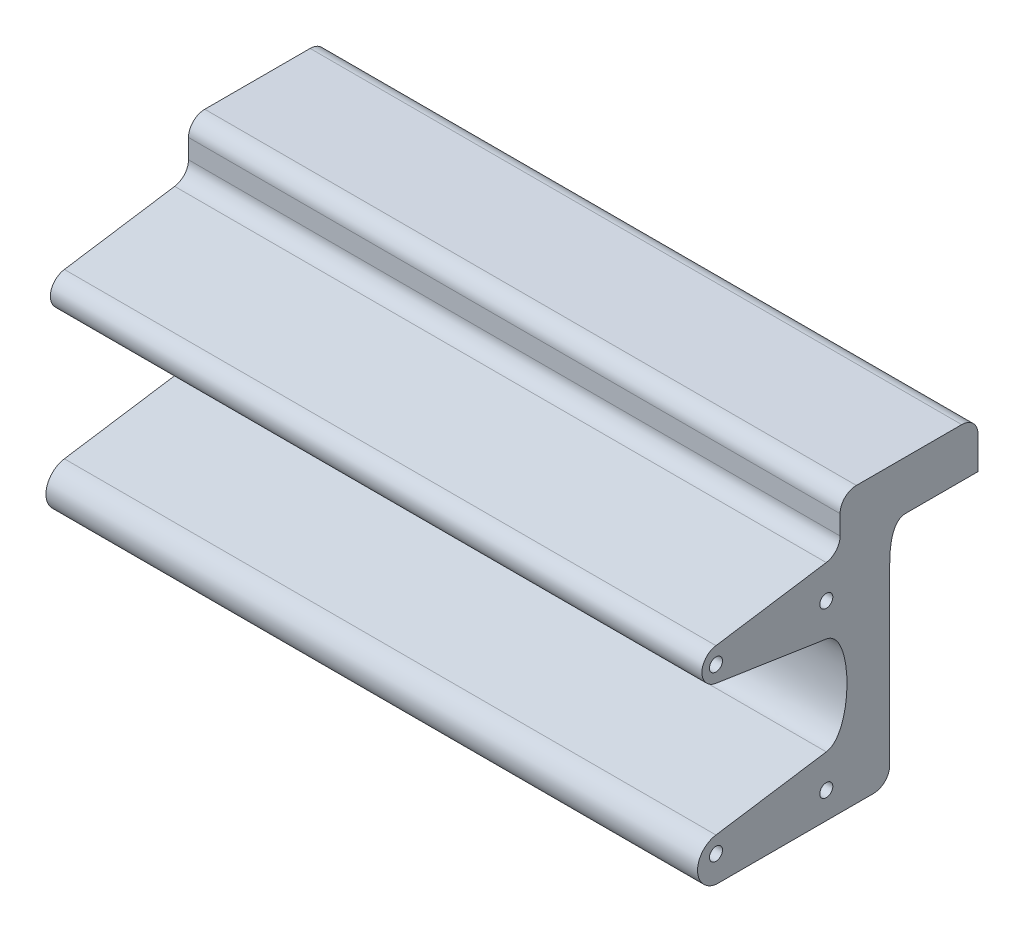
ISO-10303-21;
HEADER;
FILE_DESCRIPTION(('STEP AP214'),'2;1');
FILE_NAME('part.step','',(''),(''),'','','');
FILE_SCHEMA(('AUTOMOTIVE_DESIGN { 1 0 10303 214 1 1 1 1 }'));
ENDSEC;
DATA;
#1=APPLICATION_CONTEXT('core data for automotive mechanical design processes');
#2=APPLICATION_PROTOCOL_DEFINITION('international standard','automotive_design',2000,#1);
#3=PRODUCT_CONTEXT('',#1,'mechanical');
#4=PRODUCT('Part','Part','',(#3));
#5=PRODUCT_RELATED_PRODUCT_CATEGORY('part','',(#4));
#6=PRODUCT_DEFINITION_FORMATION('','',#4);
#7=PRODUCT_DEFINITION_CONTEXT('part definition',#1,'design');
#8=PRODUCT_DEFINITION('design','',#6,#7);
#9=PRODUCT_DEFINITION_SHAPE('','',#8);
#10=(LENGTH_UNIT() NAMED_UNIT(*) SI_UNIT(.MILLI.,.METRE.));
#11=(NAMED_UNIT(*) PLANE_ANGLE_UNIT() SI_UNIT($,.RADIAN.));
#12=(NAMED_UNIT(*) SI_UNIT($,.STERADIAN.) SOLID_ANGLE_UNIT());
#13=UNCERTAINTY_MEASURE_WITH_UNIT(LENGTH_MEASURE(1.E-05),#10,'distance_accuracy_value','');
#14=(GEOMETRIC_REPRESENTATION_CONTEXT(3) GLOBAL_UNCERTAINTY_ASSIGNED_CONTEXT((#13)) GLOBAL_UNIT_ASSIGNED_CONTEXT((#10,
#11,#12)) REPRESENTATION_CONTEXT('',''));
#15=CARTESIAN_POINT('',(0.,0.,0.));
#16=DIRECTION('',(0.,0.,1.));
#17=DIRECTION('',(1.,0.,0.));
#18=AXIS2_PLACEMENT_3D('',#15,#16,#17);
#19=CARTESIAN_POINT('',(100.,-5.51166666666667,14.8));
#20=DIRECTION('',(-1.,0.,0.));
#21=DIRECTION('',(0.,0.,1.));
#22=AXIS2_PLACEMENT_3D('',#19,#20,#21);
#23=PLANE('',#22);
#24=DIRECTION('',(0.,1.,0.));
#25=VECTOR('',#24,1.);
#26=CARTESIAN_POINT('',(100.,12.25,-11.05));
#27=LINE('',#26,#25);
#28=CARTESIAN_POINT('',(100.,-2.74999999999999,-11.05));
#29=VERTEX_POINT('',#28);
#30=CARTESIAN_POINT('',(100.,7.25,-11.05));
#31=VERTEX_POINT('',#30);
#32=EDGE_CURVE('E316',#29,#31,#27,.T.);
#33=ORIENTED_EDGE('',*,*,#32,.T.);
#34=CARTESIAN_POINT('',(100.,7.25,-6.05000000000001));
#35=DIRECTION('',(-1.,0.,0.));
#36=DIRECTION('',(0.,0.,1.));
#37=AXIS2_PLACEMENT_3D('',#34,#35,#36);
#38=CIRCLE('',#37,5.);
#39=CARTESIAN_POINT('',(100.,12.25,-6.05000000000001));
#40=VERTEX_POINT('',#39);
#41=EDGE_CURVE('E353',#31,#40,#38,.F.);
#42=ORIENTED_EDGE('',*,*,#41,.T.);
#43=DIRECTION('',(0.,0.,1.));
#44=VECTOR('',#43,1.);
#45=CARTESIAN_POINT('',(100.,12.25,-11.05));
#46=LINE('',#45,#44);
#47=CARTESIAN_POINT('',(100.,12.25,26.2833333333333));
#48=VERTEX_POINT('',#47);
#49=EDGE_CURVE('E376',#40,#48,#46,.T.);
#50=ORIENTED_EDGE('',*,*,#49,.T.);
#51=CARTESIAN_POINT('',(100.,7.25000000000001,26.2833333333333));
#52=DIRECTION('',(-1.,0.,0.));
#53=DIRECTION('',(0.,0.,1.));
#54=AXIS2_PLACEMENT_3D('',#51,#52,#53);
#55=CIRCLE('',#54,5.);
#56=CARTESIAN_POINT('',(100.,7.25000000000001,31.2833333333333));
#57=VERTEX_POINT('',#56);
#58=EDGE_CURVE('E351',#48,#57,#55,.F.);
#59=ORIENTED_EDGE('',*,*,#58,.T.);
#60=DIRECTION('',(0.,-1.,0.));
#61=VECTOR('',#60,1.);
#62=CARTESIAN_POINT('',(100.,12.25,31.2833333333333));
#63=LINE('',#62,#61);
#64=CARTESIAN_POINT('',(100.,1.31089229297101,31.2833333333333));
#65=VERTEX_POINT('',#64);
#66=EDGE_CURVE('E165',#57,#65,#63,.T.);
#67=ORIENTED_EDGE('',*,*,#66,.T.);
#68=CARTESIAN_POINT('',(100.,1.31089229297101,36.2833333333333));
#69=DIRECTION('',(-1.,0.,0.));
#70=DIRECTION('',(0.,0.,1.));
#71=AXIS2_PLACEMENT_3D('',#68,#69,#70);
#72=CIRCLE('',#71,5.);
#73=CARTESIAN_POINT('',(100.,-3.63209960127043,35.5304514478669));
#74=VERTEX_POINT('',#73);
#75=EDGE_CURVE('E11',#65,#74,#72,.T.);
#76=ORIENTED_EDGE('',*,*,#75,.T.);
#77=DIRECTION('',(0.,-0.15057637709328,0.988598378848288));
#78=VECTOR('',#77,1.);
#79=CARTESIAN_POINT('',(100.,-2.98520833333334,31.2833333333333));
#80=LINE('',#79,#78);
#81=CARTESIAN_POINT('',(100.,-8.78833333333335,69.3833333333333));
#82=VERTEX_POINT('',#81);
#83=EDGE_CURVE('E153',#74,#82,#80,.T.);
#84=ORIENTED_EDGE('',*,*,#83,.T.);
#85=CARTESIAN_POINT('',(100.,-13.7966666666667,68.620499097769));
#86=DIRECTION('',(1.,0.,0.));
#87=DIRECTION('',(0.,0.,-1.));
#88=AXIS2_PLACEMENT_3D('',#85,#86,#87);
#89=CIRCLE('',#88,5.06609502957916);
#90=CARTESIAN_POINT('',(100.,-18.805,69.3833333333333));
#91=VERTEX_POINT('',#90);
#92=EDGE_CURVE('E158',#82,#91,#89,.T.);
#93=ORIENTED_EDGE('',*,*,#92,.T.);
#94=DIRECTION('',(0.,-0.15057637709328,-0.988598378848287));
#95=VECTOR('',#94,1.);
#96=CARTESIAN_POINT('',(100.,-18.805,69.3833333333333));
#97=LINE('',#96,#95);
#98=CARTESIAN_POINT('',(100.,-23.9633333333333,35.5166666666667));
#99=VERTEX_POINT('',#98);
#100=EDGE_CURVE('E180',#91,#99,#97,.T.);
#101=ORIENTED_EDGE('',*,*,#100,.T.);
#102=CARTESIAN_POINT('',(100.,-23.9633333333333,35.5166666666667));
#103=CARTESIAN_POINT('',(100.,-25.2529166666667,27.05));
#104=CARTESIAN_POINT('',(100.,-52.67375,27.05));
#105=CARTESIAN_POINT('',(100.,-53.9633333333333,35.5166666666666));
#106=B_SPLINE_CURVE_WITH_KNOTS('',3,(#102,#103,#104,#105),.UNSPECIFIED.,.F.,.F.,(4,4),(0.,1.),.UNSPECIFIED.);
#107=CARTESIAN_POINT('',(100.,-53.9633333333333,35.5166666666666));
#108=VERTEX_POINT('',#107);
#109=EDGE_CURVE('E182',#99,#108,#106,.T.);
#110=ORIENTED_EDGE('',*,*,#109,.T.);
#111=DIRECTION('',(0.,-0.15057637709328,0.988598378848287));
#112=VECTOR('',#111,1.);
#113=CARTESIAN_POINT('',(100.,-59.1216666666667,69.3833333333333));
#114=LINE('',#113,#112);
#115=CARTESIAN_POINT('',(100.,-59.1216666666667,69.3833333333333));
#116=VERTEX_POINT('',#115);
#117=EDGE_CURVE('E190',#108,#116,#114,.T.);
#118=ORIENTED_EDGE('',*,*,#117,.T.);
#119=CARTESIAN_POINT('',(100.,-65.7008333333333,68.3812407726378));
#120=DIRECTION('',(1.,0.,0.));
#121=DIRECTION('',(0.,0.,-1.));
#122=AXIS2_PLACEMENT_3D('',#119,#120,#121);
#123=CIRCLE('',#122,6.65504496814102);
#124=CARTESIAN_POINT('',(100.,-72.28,69.3833333333333));
#125=VERTEX_POINT('',#124);
#126=EDGE_CURVE('E398',#116,#125,#123,.T.);
#127=ORIENTED_EDGE('',*,*,#126,.T.);
#128=DIRECTION('',(0.,0.,-1.));
#129=VECTOR('',#128,1.);
#130=CARTESIAN_POINT('',(100.,-72.28,69.3833333333333));
#131=LINE('',#130,#129);
#132=CARTESIAN_POINT('',(100.,-72.28,21.05));
#133=VERTEX_POINT('',#132);
#134=EDGE_CURVE('E394',#125,#133,#131,.T.);
#135=ORIENTED_EDGE('',*,*,#134,.T.);
#136=CARTESIAN_POINT('',(100.,-67.28,21.05));
#137=DIRECTION('',(-1.,0.,0.));
#138=DIRECTION('',(0.,0.,1.));
#139=AXIS2_PLACEMENT_3D('',#136,#137,#138);
#140=CIRCLE('',#139,5.);
#141=CARTESIAN_POINT('',(100.,-67.28,16.05));
#142=VERTEX_POINT('',#141);
#143=EDGE_CURVE('E50',#133,#142,#140,.F.);
#144=ORIENTED_EDGE('',*,*,#143,.T.);
#145=DIRECTION('',(0.,1.,0.));
#146=VECTOR('',#145,1.);
#147=CARTESIAN_POINT('',(100.,-72.28,16.05));
#148=LINE('',#147,#146);
#149=CARTESIAN_POINT('',(100.,-13.7966666666667,16.05));
#150=VERTEX_POINT('',#149);
#151=EDGE_CURVE('E269',#142,#150,#148,.T.);
#152=ORIENTED_EDGE('',*,*,#151,.T.);
#153=CARTESIAN_POINT('',(100.,-13.7966666666667,16.05));
#154=CARTESIAN_POINT('',(100.,-2.75,16.05));
#155=CARTESIAN_POINT('',(100.,-2.74999999999999,11.05));
#156=B_SPLINE_CURVE_WITH_KNOTS('',2,(#153,#154,#155),.UNSPECIFIED.,.F.,.F.,(3,3),(0.,1.),.UNSPECIFIED.);
#157=CARTESIAN_POINT('',(100.,-2.74999999999999,11.05));
#158=VERTEX_POINT('',#157);
#159=EDGE_CURVE('E262',#150,#158,#156,.T.);
#160=ORIENTED_EDGE('',*,*,#159,.T.);
#161=DIRECTION('',(0.,0.,-1.));
#162=VECTOR('',#161,1.);
#163=CARTESIAN_POINT('',(100.,-2.74999999999999,-11.05));
#164=LINE('',#163,#162);
#165=EDGE_CURVE('E268',#158,#29,#164,.T.);
#166=ORIENTED_EDGE('',*,*,#165,.T.);
#167=EDGE_LOOP('',(#33,#42,#50,#59,#67,#76,#84,#93,#101,#110,#118,#127,#135,#144,#152,#160,#166));
#168=FACE_BOUND('',#167,.T.);
#169=CARTESIAN_POINT('',(100.,-13.7966666666667,69.3833333333333));
#170=DIRECTION('',(1.,0.,0.));
#171=DIRECTION('',(0.,0.,-1.));
#172=AXIS2_PLACEMENT_3D('',#169,#170,#171);
#173=CIRCLE('',#172,2.);
#174=CARTESIAN_POINT('',(100.,-13.7966666666667,67.3833333333333));
#175=VERTEX_POINT('',#174);
#176=EDGE_CURVE('E280',#175,#175,#173,.T.);
#177=ORIENTED_EDGE('',*,*,#176,.F.);
#178=EDGE_LOOP('',(#177));
#179=FACE_BOUND('',#178,.T.);
#180=CARTESIAN_POINT('',(100.,-64.1216666666667,35.5166666666666));
#181=DIRECTION('',(1.,0.,0.));
#182=DIRECTION('',(0.,0.,-1.));
#183=AXIS2_PLACEMENT_3D('',#180,#181,#182);
#184=CIRCLE('',#183,2.);
#185=CARTESIAN_POINT('',(100.,-64.1216666666667,33.5166666666666));
#186=VERTEX_POINT('',#185);
#187=EDGE_CURVE('E414',#186,#186,#184,.T.);
#188=ORIENTED_EDGE('',*,*,#187,.F.);
#189=EDGE_LOOP('',(#188));
#190=FACE_BOUND('',#189,.T.);
#191=CARTESIAN_POINT('',(100.,-13.7966666666667,35.5166666666666));
#192=DIRECTION('',(1.,0.,0.));
#193=DIRECTION('',(0.,0.,-1.));
#194=AXIS2_PLACEMENT_3D('',#191,#192,#193);
#195=CIRCLE('',#194,2.);
#196=CARTESIAN_POINT('',(100.,-13.7966666666667,33.5166666666666));
#197=VERTEX_POINT('',#196);
#198=EDGE_CURVE('E420',#197,#197,#195,.T.);
#199=ORIENTED_EDGE('',*,*,#198,.F.);
#200=EDGE_LOOP('',(#199));
#201=FACE_BOUND('',#200,.T.);
#202=CARTESIAN_POINT('',(100.,-64.1216666666667,69.3833333333333));
#203=DIRECTION('',(1.,0.,0.));
#204=DIRECTION('',(0.,0.,-1.));
#205=AXIS2_PLACEMENT_3D('',#202,#203,#204);
#206=CIRCLE('',#205,2.);
#207=CARTESIAN_POINT('',(100.,-64.1216666666667,67.3833333333333));
#208=VERTEX_POINT('',#207);
#209=EDGE_CURVE('E426',#208,#208,#206,.T.);
#210=ORIENTED_EDGE('',*,*,#209,.F.);
#211=EDGE_LOOP('',(#210));
#212=FACE_BOUND('',#211,.T.);
#213=ADVANCED_FACE('F35',(#168,#179,#190,#201,#212),#23,.F.);
#214=CARTESIAN_POINT('',(-100.,-5.51166666666667,14.8));
#215=DIRECTION('',(-1.,0.,0.));
#216=DIRECTION('',(0.,0.,1.));
#217=AXIS2_PLACEMENT_3D('',#214,#215,#216);
#218=PLANE('',#217);
#219=CARTESIAN_POINT('',(-100.,-13.7966666666667,35.5166666666666));
#220=DIRECTION('',(1.,0.,0.));
#221=DIRECTION('',(0.,0.,-1.));
#222=AXIS2_PLACEMENT_3D('',#219,#220,#221);
#223=CIRCLE('',#222,2.);
#224=CARTESIAN_POINT('',(-100.,-13.7966666666667,33.5166666666666));
#225=VERTEX_POINT('',#224);
#226=EDGE_CURVE('E423',#225,#225,#223,.T.);
#227=ORIENTED_EDGE('',*,*,#226,.T.);
#228=EDGE_LOOP('',(#227));
#229=FACE_BOUND('',#228,.T.);
#230=CARTESIAN_POINT('',(-100.,-13.7966666666667,69.3833333333333));
#231=DIRECTION('',(1.,0.,0.));
#232=DIRECTION('',(0.,0.,-1.));
#233=AXIS2_PLACEMENT_3D('',#230,#231,#232);
#234=CIRCLE('',#233,2.);
#235=CARTESIAN_POINT('',(-100.,-13.7966666666667,67.3833333333333));
#236=VERTEX_POINT('',#235);
#237=EDGE_CURVE('E411',#236,#236,#234,.T.);
#238=ORIENTED_EDGE('',*,*,#237,.T.);
#239=EDGE_LOOP('',(#238));
#240=FACE_BOUND('',#239,.T.);
#241=DIRECTION('',(0.,0.,1.));
#242=VECTOR('',#241,1.);
#243=CARTESIAN_POINT('',(-100.,12.25,11.05));
#244=LINE('',#243,#242);
#245=CARTESIAN_POINT('',(-100.,12.25,-6.05000000000001));
#246=VERTEX_POINT('',#245);
#247=CARTESIAN_POINT('',(-100.,12.25,26.2833333333333));
#248=VERTEX_POINT('',#247);
#249=EDGE_CURVE('E279',#246,#248,#244,.T.);
#250=ORIENTED_EDGE('',*,*,#249,.F.);
#251=CARTESIAN_POINT('',(-100.,7.25,-6.05000000000001));
#252=DIRECTION('',(-1.,0.,0.));
#253=DIRECTION('',(0.,0.,1.));
#254=AXIS2_PLACEMENT_3D('',#251,#252,#253);
#255=CIRCLE('',#254,5.);
#256=CARTESIAN_POINT('',(-100.,7.25,-11.05));
#257=VERTEX_POINT('',#256);
#258=EDGE_CURVE('E346',#246,#257,#255,.T.);
#259=ORIENTED_EDGE('',*,*,#258,.T.);
#260=DIRECTION('',(0.,1.,0.));
#261=VECTOR('',#260,1.);
#262=CARTESIAN_POINT('',(-100.,12.25,-11.05));
#263=LINE('',#262,#261);
#264=CARTESIAN_POINT('',(-100.,-2.74999999999999,-11.05));
#265=VERTEX_POINT('',#264);
#266=EDGE_CURVE('E276',#265,#257,#263,.T.);
#267=ORIENTED_EDGE('',*,*,#266,.F.);
#268=DIRECTION('',(0.,0.,-1.));
#269=VECTOR('',#268,1.);
#270=CARTESIAN_POINT('',(-100.,-2.74999999999999,-11.05));
#271=LINE('',#270,#269);
#272=CARTESIAN_POINT('',(-100.,-2.74999999999999,11.05));
#273=VERTEX_POINT('',#272);
#274=EDGE_CURVE('E311',#273,#265,#271,.T.);
#275=ORIENTED_EDGE('',*,*,#274,.F.);
#276=CARTESIAN_POINT('',(-100.,-13.7966666666667,16.05));
#277=CARTESIAN_POINT('',(-100.,-2.75,16.05));
#278=CARTESIAN_POINT('',(-100.,-2.74999999999999,11.05));
#279=B_SPLINE_CURVE_WITH_KNOTS('',2,(#276,#277,#278),.UNSPECIFIED.,.F.,.F.,(3,3),(0.,1.),.UNSPECIFIED.);
#280=CARTESIAN_POINT('',(-100.,-13.7966666666667,16.05));
#281=VERTEX_POINT('',#280);
#282=EDGE_CURVE('E307',#281,#273,#279,.T.);
#283=ORIENTED_EDGE('',*,*,#282,.F.);
#284=DIRECTION('',(0.,1.,0.));
#285=VECTOR('',#284,1.);
#286=CARTESIAN_POINT('',(-100.,-72.28,16.05));
#287=LINE('',#286,#285);
#288=CARTESIAN_POINT('',(-100.,-67.28,16.05));
#289=VERTEX_POINT('',#288);
#290=EDGE_CURVE('E305',#289,#281,#287,.T.);
#291=ORIENTED_EDGE('',*,*,#290,.F.);
#292=CARTESIAN_POINT('',(-100.,-67.28,21.05));
#293=DIRECTION('',(-1.,0.,0.));
#294=DIRECTION('',(0.,0.,1.));
#295=AXIS2_PLACEMENT_3D('',#292,#293,#294);
#296=CIRCLE('',#295,5.);
#297=CARTESIAN_POINT('',(-100.,-72.28,21.05));
#298=VERTEX_POINT('',#297);
#299=EDGE_CURVE('E342',#289,#298,#296,.T.);
#300=ORIENTED_EDGE('',*,*,#299,.T.);
#301=DIRECTION('',(0.,0.,-1.));
#302=VECTOR('',#301,1.);
#303=CARTESIAN_POINT('',(-100.,-72.28,31.2833333333333));
#304=LINE('',#303,#302);
#305=CARTESIAN_POINT('',(-100.,-72.28,69.3833333333333));
#306=VERTEX_POINT('',#305);
#307=EDGE_CURVE('E303',#306,#298,#304,.T.);
#308=ORIENTED_EDGE('',*,*,#307,.F.);
#309=CARTESIAN_POINT('',(-100.,-65.7008333333333,68.3812407726378));
#310=DIRECTION('',(1.,0.,0.));
#311=DIRECTION('',(0.,0.,-1.));
#312=AXIS2_PLACEMENT_3D('',#309,#310,#311);
#313=CIRCLE('',#312,6.65504496814102);
#314=CARTESIAN_POINT('',(-100.,-59.1216666666667,69.3833333333333));
#315=VERTEX_POINT('',#314);
#316=EDGE_CURVE('E300',#315,#306,#313,.T.);
#317=ORIENTED_EDGE('',*,*,#316,.F.);
#318=DIRECTION('',(0.,-0.15057637709328,0.988598378848287));
#319=VECTOR('',#318,1.);
#320=CARTESIAN_POINT('',(-100.,-59.1216666666667,69.3833333333333));
#321=LINE('',#320,#319);
#322=CARTESIAN_POINT('',(-100.,-53.9633333333333,35.5166666666666));
#323=VERTEX_POINT('',#322);
#324=EDGE_CURVE('E295',#323,#315,#321,.T.);
#325=ORIENTED_EDGE('',*,*,#324,.F.);
#326=CARTESIAN_POINT('',(-100.,-23.9633333333333,35.5166666666667));
#327=CARTESIAN_POINT('',(-100.,-25.2529166666667,27.05));
#328=CARTESIAN_POINT('',(-100.,-52.67375,27.05));
#329=CARTESIAN_POINT('',(-100.,-53.9633333333333,35.5166666666666));
#330=B_SPLINE_CURVE_WITH_KNOTS('',3,(#326,#327,#328,#329),.UNSPECIFIED.,.F.,.F.,(4,4),(0.,1.),.UNSPECIFIED.);
#331=CARTESIAN_POINT('',(-100.,-23.9633333333333,35.5166666666667));
#332=VERTEX_POINT('',#331);
#333=EDGE_CURVE('E291',#332,#323,#330,.T.);
#334=ORIENTED_EDGE('',*,*,#333,.F.);
#335=DIRECTION('',(0.,-0.15057637709328,-0.988598378848287));
#336=VECTOR('',#335,1.);
#337=CARTESIAN_POINT('',(-100.,-18.805,69.3833333333333));
#338=LINE('',#337,#336);
#339=CARTESIAN_POINT('',(-100.,-18.805,69.3833333333333));
#340=VERTEX_POINT('',#339);
#341=EDGE_CURVE('E289',#340,#332,#338,.T.);
#342=ORIENTED_EDGE('',*,*,#341,.F.);
#343=CARTESIAN_POINT('',(-100.,-13.7966666666667,68.620499097769));
#344=DIRECTION('',(1.,0.,0.));
#345=DIRECTION('',(0.,0.,-1.));
#346=AXIS2_PLACEMENT_3D('',#343,#344,#345);
#347=CIRCLE('',#346,5.06609502957916);
#348=CARTESIAN_POINT('',(-100.,-8.78833333333335,69.3833333333333));
#349=VERTEX_POINT('',#348);
#350=EDGE_CURVE('E287',#349,#340,#347,.T.);
#351=ORIENTED_EDGE('',*,*,#350,.F.);
#352=DIRECTION('',(0.,-0.15057637709328,0.988598378848288));
#353=VECTOR('',#352,1.);
#354=CARTESIAN_POINT('',(-100.,-2.98520833333334,31.2833333333333));
#355=LINE('',#354,#353);
#356=CARTESIAN_POINT('',(-100.,-3.63209960127043,35.5304514478669));
#357=VERTEX_POINT('',#356);
#358=EDGE_CURVE('E171',#357,#349,#355,.T.);
#359=ORIENTED_EDGE('',*,*,#358,.F.);
#360=CARTESIAN_POINT('',(-100.,1.31089229297101,36.2833333333333));
#361=DIRECTION('',(-1.,0.,0.));
#362=DIRECTION('',(0.,0.,1.));
#363=AXIS2_PLACEMENT_3D('',#360,#361,#362);
#364=CIRCLE('',#363,5.);
#365=CARTESIAN_POINT('',(-100.,1.31089229297101,31.2833333333333));
#366=VERTEX_POINT('',#365);
#367=EDGE_CURVE('E43',#357,#366,#364,.F.);
#368=ORIENTED_EDGE('',*,*,#367,.T.);
#369=DIRECTION('',(0.,-1.,0.));
#370=VECTOR('',#369,1.);
#371=CARTESIAN_POINT('',(-100.,12.25,31.2833333333333));
#372=LINE('',#371,#370);
#373=CARTESIAN_POINT('',(-100.,7.25000000000001,31.2833333333333));
#374=VERTEX_POINT('',#373);
#375=EDGE_CURVE('E283',#374,#366,#372,.T.);
#376=ORIENTED_EDGE('',*,*,#375,.F.);
#377=CARTESIAN_POINT('',(-100.,7.25000000000001,26.2833333333333));
#378=DIRECTION('',(-1.,0.,0.));
#379=DIRECTION('',(0.,0.,1.));
#380=AXIS2_PLACEMENT_3D('',#377,#378,#379);
#381=CIRCLE('',#380,5.);
#382=EDGE_CURVE('E344',#374,#248,#381,.T.);
#383=ORIENTED_EDGE('',*,*,#382,.T.);
#384=EDGE_LOOP('',(#250,#259,#267,#275,#283,#291,#300,#308,#317,#325,#334,#342,#351,#359,#368,
#376,#383));
#385=FACE_BOUND('',#384,.T.);
#386=CARTESIAN_POINT('',(-100.,-64.1216666666667,35.5166666666666));
#387=DIRECTION('',(1.,0.,0.));
#388=DIRECTION('',(0.,0.,-1.));
#389=AXIS2_PLACEMENT_3D('',#386,#387,#388);
#390=CIRCLE('',#389,2.);
#391=CARTESIAN_POINT('',(-100.,-64.1216666666667,33.5166666666666));
#392=VERTEX_POINT('',#391);
#393=EDGE_CURVE('E417',#392,#392,#390,.T.);
#394=ORIENTED_EDGE('',*,*,#393,.T.);
#395=EDGE_LOOP('',(#394));
#396=FACE_BOUND('',#395,.T.);
#397=CARTESIAN_POINT('',(-100.,-64.1216666666667,69.3833333333333));
#398=DIRECTION('',(1.,0.,0.));
#399=DIRECTION('',(0.,0.,-1.));
#400=AXIS2_PLACEMENT_3D('',#397,#398,#399);
#401=CIRCLE('',#400,2.);
#402=CARTESIAN_POINT('',(-100.,-64.1216666666667,67.3833333333333));
#403=VERTEX_POINT('',#402);
#404=EDGE_CURVE('E429',#403,#403,#401,.T.);
#405=ORIENTED_EDGE('',*,*,#404,.T.);
#406=EDGE_LOOP('',(#405));
#407=FACE_BOUND('',#406,.T.);
#408=ADVANCED_FACE('F222',(#229,#240,#385,#396,#407),#218,.T.);
#409=CARTESIAN_POINT('',(100.,12.25,-11.05));
#410=DIRECTION('',(0.,0.,1.));
#411=DIRECTION('',(0.,-1.,0.));
#412=AXIS2_PLACEMENT_3D('',#409,#410,#411);
#413=PLANE('',#412);
#414=ORIENTED_EDGE('',*,*,#266,.T.);
#415=DIRECTION('',(-1.,0.,0.));
#416=VECTOR('',#415,1.);
#417=CARTESIAN_POINT('',(100.,7.25,-11.05));
#418=LINE('',#417,#416);
#419=EDGE_CURVE('E348',#257,#31,#418,.F.);
#420=ORIENTED_EDGE('',*,*,#419,.T.);
#421=ORIENTED_EDGE('',*,*,#32,.F.);
#422=DIRECTION('',(-1.,0.,0.));
#423=VECTOR('',#422,1.);
#424=CARTESIAN_POINT('',(100.,-2.74999999999999,-11.05));
#425=LINE('',#424,#423);
#426=EDGE_CURVE('E275',#29,#265,#425,.T.);
#427=ORIENTED_EDGE('',*,*,#426,.T.);
#428=EDGE_LOOP('',(#414,#420,#421,#427));
#429=FACE_BOUND('',#428,.T.);
#430=ADVANCED_FACE('F218',(#429),#413,.F.);
#431=CARTESIAN_POINT('',(100.,12.25,11.05));
#432=DIRECTION('',(0.,-1.,0.));
#433=DIRECTION('',(0.,0.,-1.));
#434=AXIS2_PLACEMENT_3D('',#431,#432,#433);
#435=PLANE('',#434);
#436=ORIENTED_EDGE('',*,*,#49,.F.);
#437=DIRECTION('',(-1.,0.,0.));
#438=VECTOR('',#437,1.);
#439=CARTESIAN_POINT('',(100.,12.25,-6.05000000000001));
#440=LINE('',#439,#438);
#441=EDGE_CURVE('E339',#40,#246,#440,.T.);
#442=ORIENTED_EDGE('',*,*,#441,.T.);
#443=ORIENTED_EDGE('',*,*,#249,.T.);
#444=DIRECTION('',(-1.,0.,0.));
#445=VECTOR('',#444,1.);
#446=CARTESIAN_POINT('',(100.,12.25,26.2833333333333));
#447=LINE('',#446,#445);
#448=EDGE_CURVE('E174',#248,#48,#447,.F.);
#449=ORIENTED_EDGE('',*,*,#448,.T.);
#450=EDGE_LOOP('',(#436,#442,#443,#449));
#451=FACE_BOUND('',#450,.T.);
#452=ADVANCED_FACE('F214',(#451),#435,.F.);
#453=CARTESIAN_POINT('',(100.,12.25,31.2833333333333));
#454=DIRECTION('',(0.,0.,-1.));
#455=DIRECTION('',(-1.,0.,0.));
#456=AXIS2_PLACEMENT_3D('',#453,#454,#455);
#457=PLANE('',#456);
#458=ORIENTED_EDGE('',*,*,#375,.T.);
#459=DIRECTION('',(-1.,0.,0.));
#460=VECTOR('',#459,1.);
#461=CARTESIAN_POINT('',(100.,1.31089229297101,31.2833333333333));
#462=LINE('',#461,#460);
#463=EDGE_CURVE('E360',#366,#65,#462,.F.);
#464=ORIENTED_EDGE('',*,*,#463,.T.);
#465=ORIENTED_EDGE('',*,*,#66,.F.);
#466=DIRECTION('',(-1.,0.,0.));
#467=VECTOR('',#466,1.);
#468=CARTESIAN_POINT('',(100.,7.25000000000001,31.2833333333333));
#469=LINE('',#468,#467);
#470=EDGE_CURVE('E357',#57,#374,#469,.T.);
#471=ORIENTED_EDGE('',*,*,#470,.T.);
#472=EDGE_LOOP('',(#458,#464,#465,#471));
#473=FACE_BOUND('',#472,.T.);
#474=ADVANCED_FACE('F211',(#473),#457,.F.);
#475=CARTESIAN_POINT('',(100.,-2.98520833333334,31.2833333333333));
#476=DIRECTION('',(0.,-0.988598378848288,-0.15057637709328));
#477=DIRECTION('',(0.,0.15057637709328,-0.988598378848288));
#478=AXIS2_PLACEMENT_3D('',#475,#476,#477);
#479=PLANE('',#478);
#480=ORIENTED_EDGE('',*,*,#83,.F.);
#481=DIRECTION('',(-1.,0.,0.));
#482=VECTOR('',#481,1.);
#483=CARTESIAN_POINT('',(-99.9999999999999,-3.63209960127043,35.5304514478669));
#484=LINE('',#483,#482);
#485=EDGE_CURVE('E355',#74,#357,#484,.T.);
#486=ORIENTED_EDGE('',*,*,#485,.T.);
#487=ORIENTED_EDGE('',*,*,#358,.T.);
#488=DIRECTION('',(-1.,0.,0.));
#489=VECTOR('',#488,1.);
#490=CARTESIAN_POINT('',(100.,-8.78833333333335,69.3833333333333));
#491=LINE('',#490,#489);
#492=EDGE_CURVE('E168',#82,#349,#491,.T.);
#493=ORIENTED_EDGE('',*,*,#492,.F.);
#494=EDGE_LOOP('',(#480,#486,#487,#493));
#495=FACE_BOUND('',#494,.T.);
#496=ADVANCED_FACE('F169',(#495),#479,.F.);
#497=CARTESIAN_POINT('',(100.,-13.7966666666667,68.620499097769));
#498=DIRECTION('',(-1.,0.,0.));
#499=DIRECTION('',(0.,0.,1.));
#500=AXIS2_PLACEMENT_3D('',#497,#498,#499);
#501=CYLINDRICAL_SURFACE('',#500,5.06609502957916);
#502=ORIENTED_EDGE('',*,*,#350,.T.);
#503=DIRECTION('',(-1.,0.,0.));
#504=VECTOR('',#503,1.);
#505=CARTESIAN_POINT('',(100.,-18.805,69.3833333333333));
#506=LINE('',#505,#504);
#507=EDGE_CURVE('E175',#91,#340,#506,.T.);
#508=ORIENTED_EDGE('',*,*,#507,.F.);
#509=ORIENTED_EDGE('',*,*,#92,.F.);
#510=ORIENTED_EDGE('',*,*,#492,.T.);
#511=EDGE_LOOP('',(#502,#508,#509,#510));
#512=FACE_BOUND('',#511,.T.);
#513=ADVANCED_FACE('F177',(#512),#501,.T.);
#514=CARTESIAN_POINT('',(100.,-18.805,69.3833333333333));
#515=DIRECTION('',(0.,0.988598378848288,-0.15057637709328));
#516=DIRECTION('',(0.,0.15057637709328,0.988598378848288));
#517=AXIS2_PLACEMENT_3D('',#514,#515,#516);
#518=PLANE('',#517);
#519=ORIENTED_EDGE('',*,*,#341,.T.);
#520=DIRECTION('',(-1.,0.,0.));
#521=VECTOR('',#520,1.);
#522=CARTESIAN_POINT('',(100.,-23.9633333333333,35.5166666666667));
#523=LINE('',#522,#521);
#524=EDGE_CURVE('E334',#99,#332,#523,.T.);
#525=ORIENTED_EDGE('',*,*,#524,.F.);
#526=ORIENTED_EDGE('',*,*,#100,.F.);
#527=ORIENTED_EDGE('',*,*,#507,.T.);
#528=EDGE_LOOP('',(#519,#525,#526,#527));
#529=FACE_BOUND('',#528,.T.);
#530=ADVANCED_FACE('F201',(#529),#518,.F.);
#531=DIRECTION('',(-1.,0.,0.));
#532=VECTOR('',#531,1.);
#533=SURFACE_OF_LINEAR_EXTRUSION('',#106,#532);
#534=ORIENTED_EDGE('',*,*,#333,.T.);
#535=DIRECTION('',(-1.,0.,0.));
#536=VECTOR('',#535,1.);
#537=CARTESIAN_POINT('',(100.,-53.9633333333333,35.5166666666666));
#538=LINE('',#537,#536);
#539=EDGE_CURVE('E331',#108,#323,#538,.T.);
#540=ORIENTED_EDGE('',*,*,#539,.F.);
#541=ORIENTED_EDGE('',*,*,#109,.F.);
#542=ORIENTED_EDGE('',*,*,#524,.T.);
#543=EDGE_LOOP('',(#534,#540,#541,#542));
#544=FACE_BOUND('',#543,.T.);
#545=ADVANCED_FACE('F196',(#544),#533,.F.);
#546=CARTESIAN_POINT('',(100.,-59.1216666666667,69.3833333333333));
#547=DIRECTION('',(0.,-0.988598378848288,-0.15057637709328));
#548=DIRECTION('',(0.,0.15057637709328,-0.988598378848288));
#549=AXIS2_PLACEMENT_3D('',#546,#547,#548);
#550=PLANE('',#549);
#551=ORIENTED_EDGE('',*,*,#324,.T.);
#552=DIRECTION('',(-1.,0.,0.));
#553=VECTOR('',#552,1.);
#554=CARTESIAN_POINT('',(100.,-59.1216666666667,69.3833333333333));
#555=LINE('',#554,#553);
#556=EDGE_CURVE('E328',#116,#315,#555,.T.);
#557=ORIENTED_EDGE('',*,*,#556,.F.);
#558=ORIENTED_EDGE('',*,*,#117,.F.);
#559=ORIENTED_EDGE('',*,*,#539,.T.);
#560=EDGE_LOOP('',(#551,#557,#558,#559));
#561=FACE_BOUND('',#560,.T.);
#562=ADVANCED_FACE('F200',(#561),#550,.F.);
#563=CARTESIAN_POINT('',(100.,-65.7008333333333,68.3812407726378));
#564=DIRECTION('',(-1.,0.,0.));
#565=DIRECTION('',(0.,0.,1.));
#566=AXIS2_PLACEMENT_3D('',#563,#564,#565);
#567=CYLINDRICAL_SURFACE('',#566,6.65504496814102);
#568=ORIENTED_EDGE('',*,*,#316,.T.);
#569=DIRECTION('',(-1.,0.,0.));
#570=VECTOR('',#569,1.);
#571=CARTESIAN_POINT('',(100.,-72.28,69.3833333333333));
#572=LINE('',#571,#570);
#573=EDGE_CURVE('E325',#125,#306,#572,.T.);
#574=ORIENTED_EDGE('',*,*,#573,.F.);
#575=ORIENTED_EDGE('',*,*,#126,.F.);
#576=ORIENTED_EDGE('',*,*,#556,.T.);
#577=EDGE_LOOP('',(#568,#574,#575,#576));
#578=FACE_BOUND('',#577,.T.);
#579=ADVANCED_FACE('F397',(#578),#567,.T.);
#580=CARTESIAN_POINT('',(100.,-72.28,31.2833333333333));
#581=DIRECTION('',(0.,1.,0.));
#582=DIRECTION('',(0.,0.,1.));
#583=AXIS2_PLACEMENT_3D('',#580,#581,#582);
#584=PLANE('',#583);
#585=ORIENTED_EDGE('',*,*,#307,.T.);
#586=DIRECTION('',(-1.,0.,0.));
#587=VECTOR('',#586,1.);
#588=CARTESIAN_POINT('',(100.,-72.28,21.05));
#589=LINE('',#588,#587);
#590=EDGE_CURVE('E58',#298,#133,#589,.F.);
#591=ORIENTED_EDGE('',*,*,#590,.T.);
#592=ORIENTED_EDGE('',*,*,#134,.F.);
#593=ORIENTED_EDGE('',*,*,#573,.T.);
#594=EDGE_LOOP('',(#585,#591,#592,#593));
#595=FACE_BOUND('',#594,.T.);
#596=ADVANCED_FACE('F392',(#595),#584,.F.);
#597=CARTESIAN_POINT('',(100.,-72.28,16.05));
#598=DIRECTION('',(0.,0.,1.));
#599=DIRECTION('',(1.,0.,0.));
#600=AXIS2_PLACEMENT_3D('',#597,#598,#599);
#601=PLANE('',#600);
#602=ORIENTED_EDGE('',*,*,#151,.F.);
#603=DIRECTION('',(-1.,0.,0.));
#604=VECTOR('',#603,1.);
#605=CARTESIAN_POINT('',(100.,-67.28,16.05));
#606=LINE('',#605,#604);
#607=EDGE_CURVE('E362',#142,#289,#606,.T.);
#608=ORIENTED_EDGE('',*,*,#607,.T.);
#609=ORIENTED_EDGE('',*,*,#290,.T.);
#610=DIRECTION('',(-1.,0.,0.));
#611=VECTOR('',#610,1.);
#612=CARTESIAN_POINT('',(100.,-13.7966666666667,16.05));
#613=LINE('',#612,#611);
#614=EDGE_CURVE('E322',#150,#281,#613,.T.);
#615=ORIENTED_EDGE('',*,*,#614,.F.);
#616=EDGE_LOOP('',(#602,#608,#609,#615));
#617=FACE_BOUND('',#616,.T.);
#618=ADVANCED_FACE('F259',(#617),#601,.F.);
#619=DIRECTION('',(-1.,0.,0.));
#620=VECTOR('',#619,1.);
#621=SURFACE_OF_LINEAR_EXTRUSION('',#156,#620);
#622=ORIENTED_EDGE('',*,*,#282,.T.);
#623=DIRECTION('',(-1.,0.,0.));
#624=VECTOR('',#623,1.);
#625=CARTESIAN_POINT('',(100.,-2.74999999999999,11.05));
#626=LINE('',#625,#624);
#627=EDGE_CURVE('E319',#158,#273,#626,.T.);
#628=ORIENTED_EDGE('',*,*,#627,.F.);
#629=ORIENTED_EDGE('',*,*,#159,.F.);
#630=ORIENTED_EDGE('',*,*,#614,.T.);
#631=EDGE_LOOP('',(#622,#628,#629,#630));
#632=FACE_BOUND('',#631,.T.);
#633=ADVANCED_FACE('F254',(#632),#621,.F.);
#634=CARTESIAN_POINT('',(100.,-2.74999999999999,-11.05));
#635=DIRECTION('',(0.,1.,0.));
#636=DIRECTION('',(0.,0.,1.));
#637=AXIS2_PLACEMENT_3D('',#634,#635,#636);
#638=PLANE('',#637);
#639=ORIENTED_EDGE('',*,*,#274,.T.);
#640=ORIENTED_EDGE('',*,*,#426,.F.);
#641=ORIENTED_EDGE('',*,*,#165,.F.);
#642=ORIENTED_EDGE('',*,*,#627,.T.);
#643=EDGE_LOOP('',(#639,#640,#641,#642));
#644=FACE_BOUND('',#643,.T.);
#645=ADVANCED_FACE('F251',(#644),#638,.F.);
#646=CARTESIAN_POINT('',(100.,-13.7966666666667,69.3833333333333));
#647=DIRECTION('',(-1.,0.,0.));
#648=DIRECTION('',(0.,0.,1.));
#649=AXIS2_PLACEMENT_3D('',#646,#647,#648);
#650=CYLINDRICAL_SURFACE('',#649,2.);
#651=ORIENTED_EDGE('',*,*,#176,.T.);
#652=EDGE_LOOP('',(#651));
#653=FACE_BOUND('',#652,.T.);
#654=ORIENTED_EDGE('',*,*,#237,.F.);
#655=EDGE_LOOP('',(#654));
#656=FACE_BOUND('',#655,.T.);
#657=ADVANCED_FACE('F248',(#653,#656),#650,.F.);
#658=CARTESIAN_POINT('',(100.,-64.1216666666667,35.5166666666666));
#659=DIRECTION('',(-1.,0.,0.));
#660=DIRECTION('',(0.,0.,1.));
#661=AXIS2_PLACEMENT_3D('',#658,#659,#660);
#662=CYLINDRICAL_SURFACE('',#661,2.);
#663=ORIENTED_EDGE('',*,*,#187,.T.);
#664=EDGE_LOOP('',(#663));
#665=FACE_BOUND('',#664,.T.);
#666=ORIENTED_EDGE('',*,*,#393,.F.);
#667=EDGE_LOOP('',(#666));
#668=FACE_BOUND('',#667,.T.);
#669=ADVANCED_FACE('F445',(#665,#668),#662,.F.);
#670=CARTESIAN_POINT('',(100.,-13.7966666666667,35.5166666666666));
#671=DIRECTION('',(-1.,0.,0.));
#672=DIRECTION('',(0.,0.,1.));
#673=AXIS2_PLACEMENT_3D('',#670,#671,#672);
#674=CYLINDRICAL_SURFACE('',#673,2.);
#675=ORIENTED_EDGE('',*,*,#198,.T.);
#676=EDGE_LOOP('',(#675));
#677=FACE_BOUND('',#676,.T.);
#678=ORIENTED_EDGE('',*,*,#226,.F.);
#679=EDGE_LOOP('',(#678));
#680=FACE_BOUND('',#679,.T.);
#681=ADVANCED_FACE('F438',(#677,#680),#674,.F.);
#682=CARTESIAN_POINT('',(100.,-64.1216666666667,69.3833333333333));
#683=DIRECTION('',(-1.,0.,0.));
#684=DIRECTION('',(0.,0.,1.));
#685=AXIS2_PLACEMENT_3D('',#682,#683,#684);
#686=CYLINDRICAL_SURFACE('',#685,2.);
#687=ORIENTED_EDGE('',*,*,#209,.T.);
#688=EDGE_LOOP('',(#687));
#689=FACE_BOUND('',#688,.T.);
#690=ORIENTED_EDGE('',*,*,#404,.F.);
#691=EDGE_LOOP('',(#690));
#692=FACE_BOUND('',#691,.T.);
#693=ADVANCED_FACE('F228',(#689,#692),#686,.F.);
#694=CARTESIAN_POINT('',(100.,7.25,-6.05000000000001));
#695=DIRECTION('',(-1.,0.,0.));
#696=DIRECTION('',(0.,0.,1.));
#697=AXIS2_PLACEMENT_3D('',#694,#695,#696);
#698=CYLINDRICAL_SURFACE('',#697,5.);
#699=ORIENTED_EDGE('',*,*,#41,.F.);
#700=ORIENTED_EDGE('',*,*,#419,.F.);
#701=ORIENTED_EDGE('',*,*,#258,.F.);
#702=ORIENTED_EDGE('',*,*,#441,.F.);
#703=EDGE_LOOP('',(#699,#700,#701,#702));
#704=FACE_BOUND('',#703,.T.);
#705=ADVANCED_FACE('F224',(#704),#698,.T.);
#706=CARTESIAN_POINT('',(100.,1.31089229297101,36.2833333333333));
#707=DIRECTION('',(1.,0.,0.));
#708=DIRECTION('',(0.,0.,-1.));
#709=AXIS2_PLACEMENT_3D('',#706,#707,#708);
#710=CYLINDRICAL_SURFACE('',#709,5.);
#711=ORIENTED_EDGE('',*,*,#75,.F.);
#712=ORIENTED_EDGE('',*,*,#463,.F.);
#713=ORIENTED_EDGE('',*,*,#367,.F.);
#714=ORIENTED_EDGE('',*,*,#485,.F.);
#715=EDGE_LOOP('',(#711,#712,#713,#714));
#716=FACE_BOUND('',#715,.T.);
#717=ADVANCED_FACE('F227',(#716),#710,.F.);
#718=CARTESIAN_POINT('',(100.,7.25000000000001,26.2833333333333));
#719=DIRECTION('',(-1.,0.,0.));
#720=DIRECTION('',(0.,0.,1.));
#721=AXIS2_PLACEMENT_3D('',#718,#719,#720);
#722=CYLINDRICAL_SURFACE('',#721,5.);
#723=ORIENTED_EDGE('',*,*,#58,.F.);
#724=ORIENTED_EDGE('',*,*,#448,.F.);
#725=ORIENTED_EDGE('',*,*,#382,.F.);
#726=ORIENTED_EDGE('',*,*,#470,.F.);
#727=EDGE_LOOP('',(#723,#724,#725,#726));
#728=FACE_BOUND('',#727,.T.);
#729=ADVANCED_FACE('F231',(#728),#722,.T.);
#730=CARTESIAN_POINT('',(100.,-67.28,21.05));
#731=DIRECTION('',(-1.,0.,0.));
#732=DIRECTION('',(0.,0.,1.));
#733=AXIS2_PLACEMENT_3D('',#730,#731,#732);
#734=CYLINDRICAL_SURFACE('',#733,5.);
#735=ORIENTED_EDGE('',*,*,#143,.F.);
#736=ORIENTED_EDGE('',*,*,#590,.F.);
#737=ORIENTED_EDGE('',*,*,#299,.F.);
#738=ORIENTED_EDGE('',*,*,#607,.F.);
#739=EDGE_LOOP('',(#735,#736,#737,#738));
#740=FACE_BOUND('',#739,.T.);
#741=ADVANCED_FACE('F37',(#740),#734,.T.);
#742=CLOSED_SHELL('',(#213,#408,#430,#452,#474,#496,#513,#530,#545,#562,#579,#596,#618,#633,
#645,#657,#669,#681,#693,#705,#717,#729,#741));
#743=MANIFOLD_SOLID_BREP('B2',#742);
#744=ADVANCED_BREP_SHAPE_REPRESENTATION('',(#18,#743),#14);
#745=SHAPE_DEFINITION_REPRESENTATION(#9,#744);
ENDSEC;
END-ISO-10303-21;
